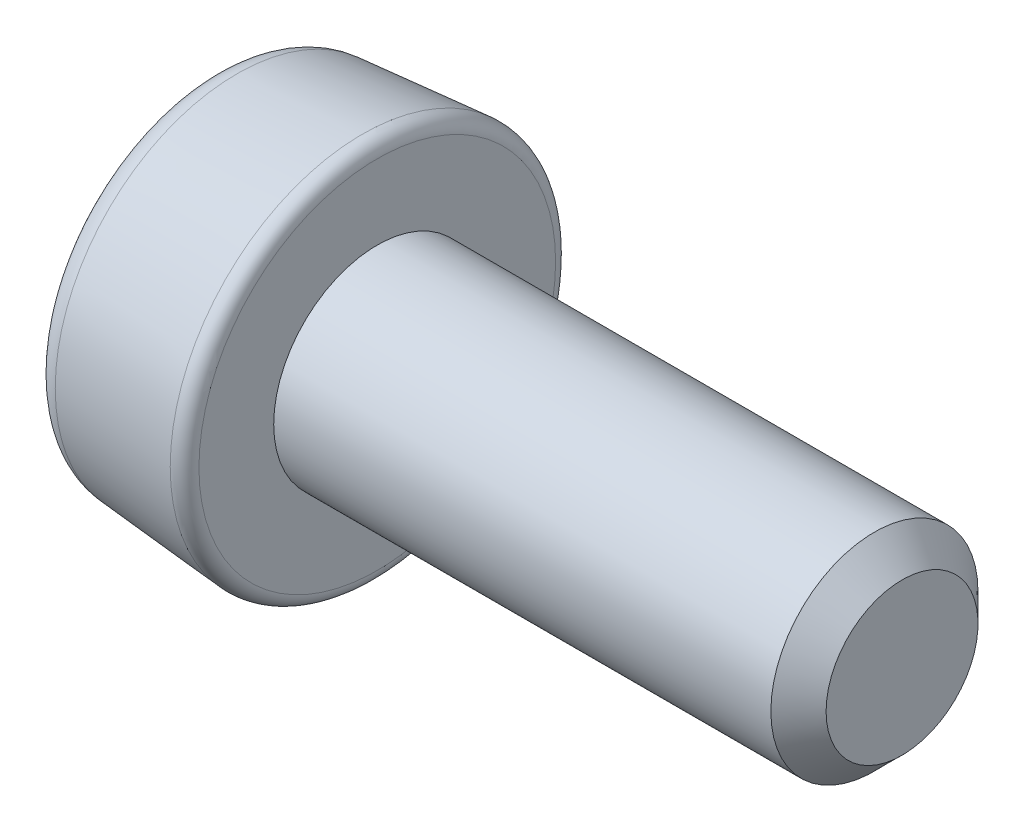
ISO-10303-21;
HEADER;
FILE_DESCRIPTION(('STEP AP214'),'2;1');
FILE_NAME('part.step','',(''),(''),'','','');
FILE_SCHEMA(('AUTOMOTIVE_DESIGN { 1 0 10303 214 1 1 1 1 }'));
ENDSEC;
DATA;
#1=APPLICATION_CONTEXT('core data for automotive mechanical design processes');
#2=APPLICATION_PROTOCOL_DEFINITION('international standard','automotive_design',2000,#1);
#3=PRODUCT_CONTEXT('',#1,'mechanical');
#4=PRODUCT('Part','Part','',(#3));
#5=PRODUCT_RELATED_PRODUCT_CATEGORY('part','',(#4));
#6=PRODUCT_DEFINITION_FORMATION('','',#4);
#7=PRODUCT_DEFINITION_CONTEXT('part definition',#1,'design');
#8=PRODUCT_DEFINITION('design','',#6,#7);
#9=PRODUCT_DEFINITION_SHAPE('','',#8);
#10=(LENGTH_UNIT() NAMED_UNIT(*) SI_UNIT(.MILLI.,.METRE.));
#11=(NAMED_UNIT(*) PLANE_ANGLE_UNIT() SI_UNIT($,.RADIAN.));
#12=(NAMED_UNIT(*) SI_UNIT($,.STERADIAN.) SOLID_ANGLE_UNIT());
#13=UNCERTAINTY_MEASURE_WITH_UNIT(LENGTH_MEASURE(1.E-05),#10,'distance_accuracy_value','');
#14=(GEOMETRIC_REPRESENTATION_CONTEXT(3) GLOBAL_UNCERTAINTY_ASSIGNED_CONTEXT((#13)) GLOBAL_UNIT_ASSIGNED_CONTEXT((#10,
#11,#12)) REPRESENTATION_CONTEXT('',''));
#15=CARTESIAN_POINT('',(0.,0.,0.));
#16=DIRECTION('',(0.,0.,1.));
#17=DIRECTION('',(1.,0.,0.));
#18=AXIS2_PLACEMENT_3D('',#15,#16,#17);
#19=CARTESIAN_POINT('',(-1.2,1.1159734236868,0.));
#20=DIRECTION('',(1.,0.,0.));
#21=DIRECTION('',(0.,0.,-1.));
#22=AXIS2_PLACEMENT_3D('',#19,#20,#21);
#23=PLANE('',#22);
#24=DIRECTION('',(0.,1.,0.));
#25=VECTOR('',#24,1.);
#26=CARTESIAN_POINT('',(-1.2,0.,0.15));
#27=LINE('',#26,#25);
#28=CARTESIAN_POINT('',(-1.2,0.349999999999998,0.15));
#29=VERTEX_POINT('',#28);
#30=CARTESIAN_POINT('',(-1.2,0.7,0.15));
#31=VERTEX_POINT('',#30);
#32=EDGE_CURVE('E229',#29,#31,#27,.T.);
#33=ORIENTED_EDGE('',*,*,#32,.F.);
#34=DIRECTION('',(0.,0.707106781186543,-0.707106781186552));
#35=VECTOR('',#34,1.);
#36=CARTESIAN_POINT('',(-1.2,0.349999999999998,0.15));
#37=LINE('',#36,#35);
#38=CARTESIAN_POINT('',(-1.2,0.150000000000001,0.35));
#39=VERTEX_POINT('',#38);
#40=EDGE_CURVE('E267',#29,#39,#37,.F.);
#41=ORIENTED_EDGE('',*,*,#40,.T.);
#42=DIRECTION('',(0.,0.,-1.));
#43=VECTOR('',#42,1.);
#44=CARTESIAN_POINT('',(-1.2,0.15,0.));
#45=LINE('',#44,#43);
#46=CARTESIAN_POINT('',(-1.2,0.150000000000007,0.699999999999999));
#47=VERTEX_POINT('',#46);
#48=EDGE_CURVE('E208',#47,#39,#45,.T.);
#49=ORIENTED_EDGE('',*,*,#48,.F.);
#50=DIRECTION('',(0.,1.,0.));
#51=VECTOR('',#50,1.);
#52=CARTESIAN_POINT('',(-1.2,0.150000000000007,0.699999999999999));
#53=LINE('',#52,#51);
#54=CARTESIAN_POINT('',(-1.2,-0.149999999999993,0.700000000000002));
#55=VERTEX_POINT('',#54);
#56=EDGE_CURVE('E154',#55,#47,#53,.T.);
#57=ORIENTED_EDGE('',*,*,#56,.F.);
#58=DIRECTION('',(0.,0.,1.));
#59=VECTOR('',#58,1.);
#60=CARTESIAN_POINT('',(-1.2,-0.15,0.));
#61=LINE('',#60,#59);
#62=CARTESIAN_POINT('',(-1.2,-0.149999999999996,0.350000000000003));
#63=VERTEX_POINT('',#62);
#64=EDGE_CURVE('E160',#63,#55,#61,.T.);
#65=ORIENTED_EDGE('',*,*,#64,.F.);
#66=DIRECTION('',(0.,0.707106781186554,0.707106781186541));
#67=VECTOR('',#66,1.);
#68=CARTESIAN_POINT('',(-1.2,-0.35,0.150000000000002));
#69=LINE('',#68,#67);
#70=CARTESIAN_POINT('',(-1.2,-0.35,0.150000000000002));
#71=VERTEX_POINT('',#70);
#72=EDGE_CURVE('E265',#63,#71,#69,.F.);
#73=ORIENTED_EDGE('',*,*,#72,.T.);
#74=DIRECTION('',(0.,1.,0.));
#75=VECTOR('',#74,1.);
#76=CARTESIAN_POINT('',(-1.2,0.,0.15));
#77=LINE('',#76,#75);
#78=CARTESIAN_POINT('',(-1.2,-0.699999999999999,0.150000000000005));
#79=VERTEX_POINT('',#78);
#80=EDGE_CURVE('E172',#79,#71,#77,.T.);
#81=ORIENTED_EDGE('',*,*,#80,.F.);
#82=DIRECTION('',(0.,0.,1.));
#83=VECTOR('',#82,1.);
#84=CARTESIAN_POINT('',(-1.2,-0.699999999999999,0.150000000000005));
#85=LINE('',#84,#83);
#86=CARTESIAN_POINT('',(-1.2,-0.700000000000001,-0.149999999999995));
#87=VERTEX_POINT('',#86);
#88=EDGE_CURVE('E177',#87,#79,#85,.T.);
#89=ORIENTED_EDGE('',*,*,#88,.F.);
#90=DIRECTION('',(0.,-1.,0.));
#91=VECTOR('',#90,1.);
#92=CARTESIAN_POINT('',(-1.2,0.,-0.15));
#93=LINE('',#92,#91);
#94=CARTESIAN_POINT('',(-1.2,-0.350000000000003,-0.149999999999998));
#95=VERTEX_POINT('',#94);
#96=EDGE_CURVE('E185',#95,#87,#93,.T.);
#97=ORIENTED_EDGE('',*,*,#96,.F.);
#98=DIRECTION('',(0.,-0.707106781186544,0.707106781186551));
#99=VECTOR('',#98,1.);
#100=CARTESIAN_POINT('',(-1.2,-0.150000000000001,-0.350000000000001));
#101=LINE('',#100,#99);
#102=CARTESIAN_POINT('',(-1.2,-0.150000000000001,-0.350000000000001));
#103=VERTEX_POINT('',#102);
#104=EDGE_CURVE('E263',#95,#103,#101,.F.);
#105=ORIENTED_EDGE('',*,*,#104,.T.);
#106=DIRECTION('',(0.,0.,1.));
#107=VECTOR('',#106,1.);
#108=CARTESIAN_POINT('',(-1.2,-0.15,0.));
#109=LINE('',#108,#107);
#110=CARTESIAN_POINT('',(-1.2,-0.150000000000002,-0.699999999999999));
#111=VERTEX_POINT('',#110);
#112=EDGE_CURVE('E191',#111,#103,#109,.T.);
#113=ORIENTED_EDGE('',*,*,#112,.F.);
#114=DIRECTION('',(0.,-1.,0.));
#115=VECTOR('',#114,1.);
#116=CARTESIAN_POINT('',(-1.2,-0.150000000000002,-0.699999999999999));
#117=LINE('',#116,#115);
#118=CARTESIAN_POINT('',(-1.2,0.149999999999998,-0.700000000000001));
#119=VERTEX_POINT('',#118);
#120=EDGE_CURVE('E198',#119,#111,#117,.T.);
#121=ORIENTED_EDGE('',*,*,#120,.F.);
#122=CARTESIAN_POINT('',(-1.2,0.149999999999999,-0.35));
#123=VERTEX_POINT('',#122);
#124=EDGE_CURVE('E207',#123,#119,#45,.T.);
#125=ORIENTED_EDGE('',*,*,#124,.F.);
#126=DIRECTION('',(0.,-0.707106781186549,-0.707106781186546));
#127=VECTOR('',#126,1.);
#128=CARTESIAN_POINT('',(-1.2,0.35,-0.15));
#129=LINE('',#128,#127);
#130=CARTESIAN_POINT('',(-1.2,0.35,-0.15));
#131=VERTEX_POINT('',#130);
#132=EDGE_CURVE('E261',#123,#131,#129,.F.);
#133=ORIENTED_EDGE('',*,*,#132,.T.);
#134=DIRECTION('',(0.,-1.,0.));
#135=VECTOR('',#134,1.);
#136=CARTESIAN_POINT('',(-1.2,0.,-0.15));
#137=LINE('',#136,#135);
#138=CARTESIAN_POINT('',(-1.2,0.7,-0.15));
#139=VERTEX_POINT('',#138);
#140=EDGE_CURVE('E215',#139,#131,#137,.T.);
#141=ORIENTED_EDGE('',*,*,#140,.F.);
#142=DIRECTION('',(0.,0.,-1.));
#143=VECTOR('',#142,1.);
#144=CARTESIAN_POINT('',(-1.2,0.7,-0.15));
#145=LINE('',#144,#143);
#146=EDGE_CURVE('E221',#31,#139,#145,.T.);
#147=ORIENTED_EDGE('',*,*,#146,.F.);
#148=EDGE_LOOP('',(#33,#41,#49,#57,#65,#73,#81,#89,#97,#105,#113,#121,#125,#133,#141,#147));
#149=FACE_BOUND('',#148,.T.);
#150=CARTESIAN_POINT('',(-1.2,0.,0.));
#151=DIRECTION('',(-1.,0.,0.));
#152=DIRECTION('',(0.,0.,1.));
#153=AXIS2_PLACEMENT_3D('',#150,#151,#152);
#154=CIRCLE('',#153,1.1159734236868);
#155=CARTESIAN_POINT('',(-1.2,0.,1.1159734236868));
#156=VERTEX_POINT('',#155);
#157=EDGE_CURVE('E255',#156,#156,#154,.T.);
#158=ORIENTED_EDGE('',*,*,#157,.T.);
#159=EDGE_LOOP('',(#158));
#160=FACE_BOUND('',#159,.T.);
#161=ADVANCED_FACE('F34',(#149,#160),#23,.F.);
#162=CARTESIAN_POINT('',(-1.,0.,0.));
#163=DIRECTION('',(-1.,0.,0.));
#164=DIRECTION('',(0.,0.,1.));
#165=AXIS2_PLACEMENT_3D('',#162,#163,#164);
#166=TOROIDAL_SURFACE('',#165,1.1159734236868,0.2);
#167=ORIENTED_EDGE('',*,*,#157,.F.);
#168=EDGE_LOOP('',(#167));
#169=FACE_BOUND('',#168,.T.);
#170=CARTESIAN_POINT('',(-1.01660909597075,0.,0.));
#171=DIRECTION('',(-1.,0.,0.));
#172=DIRECTION('',(0.,0.,1.));
#173=AXIS2_PLACEMENT_3D('',#170,#171,#172);
#174=CIRCLE('',#173,1.31528257533577);
#175=CARTESIAN_POINT('',(-1.01660909597075,0.,1.31528257533577));
#176=VERTEX_POINT('',#175);
#177=EDGE_CURVE('E252',#176,#176,#174,.T.);
#178=ORIENTED_EDGE('',*,*,#177,.T.);
#179=EDGE_LOOP('',(#178));
#180=FACE_BOUND('',#179,.T.);
#181=ADVANCED_FACE('F354',(#169,#180),#166,.T.);
#182=CARTESIAN_POINT('',(-0.108304547985375,0.,0.));
#183=DIRECTION('',(1.,0.,0.));
#184=DIRECTION('',(0.,0.,-1.));
#185=AXIS2_PLACEMENT_3D('',#182,#183,#184);
#186=CONICAL_SURFACE('',#185,1.39097462100122,0.083141231888441);
#187=ORIENTED_EDGE('',*,*,#177,.F.);
#188=EDGE_LOOP('',(#187));
#189=FACE_BOUND('',#188,.T.);
#190=CARTESIAN_POINT('',(-0.108304547985375,0.,0.));
#191=DIRECTION('',(-1.,0.,0.));
#192=DIRECTION('',(0.,0.,1.));
#193=AXIS2_PLACEMENT_3D('',#190,#191,#192);
#194=CIRCLE('',#193,1.39097462100122);
#195=CARTESIAN_POINT('',(-0.108304547985375,0.,1.39097462100122));
#196=VERTEX_POINT('',#195);
#197=EDGE_CURVE('E249',#196,#196,#194,.T.);
#198=ORIENTED_EDGE('',*,*,#197,.T.);
#199=EDGE_LOOP('',(#198));
#200=FACE_BOUND('',#199,.T.);
#201=ADVANCED_FACE('F359',(#189,#200),#186,.T.);
#202=CARTESIAN_POINT('',(-0.1,0.,0.));
#203=DIRECTION('',(-1.,0.,0.));
#204=DIRECTION('',(0.,0.,1.));
#205=AXIS2_PLACEMENT_3D('',#202,#203,#204);
#206=TOROIDAL_SURFACE('',#205,1.29132004517673,0.0999999999999999);
#207=ORIENTED_EDGE('',*,*,#197,.F.);
#208=EDGE_LOOP('',(#207));
#209=FACE_BOUND('',#208,.T.);
#210=CARTESIAN_POINT('',(0.,0.,0.));
#211=DIRECTION('',(-1.,0.,0.));
#212=DIRECTION('',(0.,0.,1.));
#213=AXIS2_PLACEMENT_3D('',#210,#211,#212);
#214=CIRCLE('',#213,1.29132004517673);
#215=CARTESIAN_POINT('',(0.,0.,1.29132004517673));
#216=VERTEX_POINT('',#215);
#217=EDGE_CURVE('E246',#216,#216,#214,.T.);
#218=ORIENTED_EDGE('',*,*,#217,.T.);
#219=EDGE_LOOP('',(#218));
#220=FACE_BOUND('',#219,.T.);
#221=ADVANCED_FACE('F532',(#209,#220),#206,.T.);
#222=CARTESIAN_POINT('',(0.,0.75,0.));
#223=DIRECTION('',(-1.,0.,0.));
#224=DIRECTION('',(0.,0.,1.));
#225=AXIS2_PLACEMENT_3D('',#222,#223,#224);
#226=PLANE('',#225);
#227=ORIENTED_EDGE('',*,*,#217,.F.);
#228=EDGE_LOOP('',(#227));
#229=FACE_BOUND('',#228,.T.);
#230=CARTESIAN_POINT('',(0.,0.,0.));
#231=DIRECTION('',(-1.,0.,0.));
#232=DIRECTION('',(0.,0.,1.));
#233=AXIS2_PLACEMENT_3D('',#230,#231,#232);
#234=CIRCLE('',#233,0.75);
#235=CARTESIAN_POINT('',(0.,0.,0.75));
#236=VERTEX_POINT('',#235);
#237=EDGE_CURVE('E243',#236,#236,#234,.T.);
#238=ORIENTED_EDGE('',*,*,#237,.T.);
#239=EDGE_LOOP('',(#238));
#240=FACE_BOUND('',#239,.T.);
#241=ADVANCED_FACE('F522',(#229,#240),#226,.F.);
#242=CARTESIAN_POINT('',(-2.78391866276236,0.,0.));
#243=DIRECTION('',(-1.,0.,0.));
#244=DIRECTION('',(0.,0.,1.));
#245=AXIS2_PLACEMENT_3D('',#242,#243,#244);
#246=CYLINDRICAL_SURFACE('',#245,0.75);
#247=ORIENTED_EDGE('',*,*,#237,.F.);
#248=EDGE_LOOP('',(#247));
#249=FACE_BOUND('',#248,.T.);
#250=CARTESIAN_POINT('',(3.6,0.,0.));
#251=DIRECTION('',(-1.,0.,0.));
#252=DIRECTION('',(0.,0.,1.));
#253=AXIS2_PLACEMENT_3D('',#250,#251,#252);
#254=CIRCLE('',#253,0.75);
#255=CARTESIAN_POINT('',(3.6,0.,0.75));
#256=VERTEX_POINT('',#255);
#257=EDGE_CURVE('E240',#256,#256,#254,.T.);
#258=ORIENTED_EDGE('',*,*,#257,.T.);
#259=EDGE_LOOP('',(#258));
#260=FACE_BOUND('',#259,.T.);
#261=ADVANCED_FACE('F512',(#249,#260),#246,.T.);
#262=CARTESIAN_POINT('',(3.8,0.,0.));
#263=DIRECTION('',(-1.,0.,0.));
#264=DIRECTION('',(0.,0.,1.));
#265=AXIS2_PLACEMENT_3D('',#262,#263,#264);
#266=CONICAL_SURFACE('',#265,0.549999999999999,0.78539816339745);
#267=ORIENTED_EDGE('',*,*,#257,.F.);
#268=EDGE_LOOP('',(#267));
#269=FACE_BOUND('',#268,.T.);
#270=CARTESIAN_POINT('',(3.8,0.,0.));
#271=DIRECTION('',(-1.,0.,0.));
#272=DIRECTION('',(0.,0.,1.));
#273=AXIS2_PLACEMENT_3D('',#270,#271,#272);
#274=CIRCLE('',#273,0.549999999999999);
#275=CARTESIAN_POINT('',(3.8,0.,0.549999999999999));
#276=VERTEX_POINT('',#275);
#277=EDGE_CURVE('E235',#276,#276,#274,.T.);
#278=ORIENTED_EDGE('',*,*,#277,.T.);
#279=EDGE_LOOP('',(#278));
#280=FACE_BOUND('',#279,.T.);
#281=ADVANCED_FACE('F502',(#269,#280),#266,.T.);
#282=CARTESIAN_POINT('',(3.8,0.,0.));
#283=DIRECTION('',(-1.,0.,0.));
#284=DIRECTION('',(0.,0.,1.));
#285=AXIS2_PLACEMENT_3D('',#282,#283,#284);
#286=PLANE('',#285);
#287=ORIENTED_EDGE('',*,*,#277,.F.);
#288=EDGE_LOOP('',(#287));
#289=FACE_BOUND('',#288,.T.);
#290=ADVANCED_FACE('F466',(#289),#286,.F.);
#291=CARTESIAN_POINT('',(-0.4,0.,-0.15));
#292=DIRECTION('',(0.,0.,-1.));
#293=DIRECTION('',(-1.,0.,0.));
#294=AXIS2_PLACEMENT_3D('',#291,#292,#293);
#295=PLANE('',#294);
#296=ORIENTED_EDGE('',*,*,#140,.T.);
#297=DIRECTION('',(1.,0.,0.));
#298=VECTOR('',#297,1.);
#299=CARTESIAN_POINT('',(-0.4,0.35,-0.15));
#300=LINE('',#299,#298);
#301=CARTESIAN_POINT('',(-0.4,0.35,-0.15));
#302=VERTEX_POINT('',#301);
#303=EDGE_CURVE('E281',#131,#302,#300,.T.);
#304=ORIENTED_EDGE('',*,*,#303,.T.);
#305=DIRECTION('',(0.,-1.,0.));
#306=VECTOR('',#305,1.);
#307=CARTESIAN_POINT('',(-0.4,0.,-0.15));
#308=LINE('',#307,#306);
#309=CARTESIAN_POINT('',(-0.4,0.7,-0.15));
#310=VERTEX_POINT('',#309);
#311=EDGE_CURVE('E218',#310,#302,#308,.T.);
#312=ORIENTED_EDGE('',*,*,#311,.F.);
#313=DIRECTION('',(-1.,0.,0.));
#314=VECTOR('',#313,1.);
#315=CARTESIAN_POINT('',(-0.4,0.7,-0.15));
#316=LINE('',#315,#314);
#317=EDGE_CURVE('E233',#310,#139,#316,.T.);
#318=ORIENTED_EDGE('',*,*,#317,.T.);
#319=EDGE_LOOP('',(#296,#304,#312,#318));
#320=FACE_BOUND('',#319,.T.);
#321=ADVANCED_FACE('F317',(#320),#295,.F.);
#322=CARTESIAN_POINT('',(-0.4,0.7,-0.15));
#323=DIRECTION('',(0.,1.,0.));
#324=DIRECTION('',(0.,0.,1.));
#325=AXIS2_PLACEMENT_3D('',#322,#323,#324);
#326=PLANE('',#325);
#327=ORIENTED_EDGE('',*,*,#146,.T.);
#328=ORIENTED_EDGE('',*,*,#317,.F.);
#329=DIRECTION('',(0.,0.,-1.));
#330=VECTOR('',#329,1.);
#331=CARTESIAN_POINT('',(-0.4,0.7,-0.15));
#332=LINE('',#331,#330);
#333=CARTESIAN_POINT('',(-0.4,0.7,0.15));
#334=VERTEX_POINT('',#333);
#335=EDGE_CURVE('E223',#334,#310,#332,.T.);
#336=ORIENTED_EDGE('',*,*,#335,.F.);
#337=DIRECTION('',(-1.,0.,0.));
#338=VECTOR('',#337,1.);
#339=CARTESIAN_POINT('',(-0.4,0.7,0.15));
#340=LINE('',#339,#338);
#341=EDGE_CURVE('E226',#334,#31,#340,.T.);
#342=ORIENTED_EDGE('',*,*,#341,.T.);
#343=EDGE_LOOP('',(#327,#328,#336,#342));
#344=FACE_BOUND('',#343,.T.);
#345=ADVANCED_FACE('F322',(#344),#326,.F.);
#346=CARTESIAN_POINT('',(-0.4,0.,0.15));
#347=DIRECTION('',(0.,0.,1.));
#348=DIRECTION('',(1.,0.,0.));
#349=AXIS2_PLACEMENT_3D('',#346,#347,#348);
#350=PLANE('',#349);
#351=DIRECTION('',(0.,1.,0.));
#352=VECTOR('',#351,1.);
#353=CARTESIAN_POINT('',(-0.4,0.,0.15));
#354=LINE('',#353,#352);
#355=CARTESIAN_POINT('',(-0.4,0.349999999999998,0.15));
#356=VERTEX_POINT('',#355);
#357=EDGE_CURVE('E220',#356,#334,#354,.T.);
#358=ORIENTED_EDGE('',*,*,#357,.F.);
#359=DIRECTION('',(-1.,0.,0.));
#360=VECTOR('',#359,1.);
#361=CARTESIAN_POINT('',(-0.4,0.349999999999998,0.15));
#362=LINE('',#361,#360);
#363=EDGE_CURVE('E258',#356,#29,#362,.T.);
#364=ORIENTED_EDGE('',*,*,#363,.T.);
#365=ORIENTED_EDGE('',*,*,#32,.T.);
#366=ORIENTED_EDGE('',*,*,#341,.F.);
#367=EDGE_LOOP('',(#358,#364,#365,#366));
#368=FACE_BOUND('',#367,.T.);
#369=ADVANCED_FACE('F326',(#368),#350,.F.);
#370=CARTESIAN_POINT('',(-0.4,0.7,-0.15));
#371=DIRECTION('',(1.,0.,0.));
#372=DIRECTION('',(0.,0.,-1.));
#373=AXIS2_PLACEMENT_3D('',#370,#371,#372);
#374=PLANE('',#373);
#375=DIRECTION('',(0.,0.,-1.));
#376=VECTOR('',#375,1.);
#377=CARTESIAN_POINT('',(-0.4,0.15,0.));
#378=LINE('',#377,#376);
#379=CARTESIAN_POINT('',(-0.4,0.150000000000007,0.699999999999999));
#380=VERTEX_POINT('',#379);
#381=CARTESIAN_POINT('',(-0.4,0.150000000000001,0.35));
#382=VERTEX_POINT('',#381);
#383=EDGE_CURVE('E199',#380,#382,#378,.T.);
#384=ORIENTED_EDGE('',*,*,#383,.T.);
#385=DIRECTION('',(0.,-0.707106781186543,0.707106781186552));
#386=VECTOR('',#385,1.);
#387=CARTESIAN_POINT('',(-0.4,0.674999999999997,-0.175000000000003));
#388=LINE('',#387,#386);
#389=EDGE_CURVE('E285',#382,#356,#388,.F.);
#390=ORIENTED_EDGE('',*,*,#389,.T.);
#391=ORIENTED_EDGE('',*,*,#357,.T.);
#392=ORIENTED_EDGE('',*,*,#335,.T.);
#393=ORIENTED_EDGE('',*,*,#311,.T.);
#394=DIRECTION('',(0.,0.707106781186549,0.707106781186546));
#395=VECTOR('',#394,1.);
#396=CARTESIAN_POINT('',(-0.4,0.525000000000001,0.025));
#397=LINE('',#396,#395);
#398=CARTESIAN_POINT('',(-0.4,0.149999999999999,-0.350000000000001));
#399=VERTEX_POINT('',#398);
#400=EDGE_CURVE('E11',#302,#399,#397,.F.);
#401=ORIENTED_EDGE('',*,*,#400,.T.);
#402=CARTESIAN_POINT('',(-0.4,0.149999999999998,-0.700000000000001));
#403=VERTEX_POINT('',#402);
#404=EDGE_CURVE('E197',#399,#403,#378,.T.);
#405=ORIENTED_EDGE('',*,*,#404,.T.);
#406=DIRECTION('',(0.,-1.,0.));
#407=VECTOR('',#406,1.);
#408=CARTESIAN_POINT('',(-0.4,-0.150000000000002,-0.699999999999999));
#409=LINE('',#408,#407);
#410=CARTESIAN_POINT('',(-0.4,-0.150000000000002,-0.699999999999999));
#411=VERTEX_POINT('',#410);
#412=EDGE_CURVE('E201',#403,#411,#409,.T.);
#413=ORIENTED_EDGE('',*,*,#412,.T.);
#414=DIRECTION('',(0.,0.,1.));
#415=VECTOR('',#414,1.);
#416=CARTESIAN_POINT('',(-0.4,-0.15,0.));
#417=LINE('',#416,#415);
#418=CARTESIAN_POINT('',(-0.4,-0.150000000000001,-0.350000000000001));
#419=VERTEX_POINT('',#418);
#420=EDGE_CURVE('E194',#411,#419,#417,.T.);
#421=ORIENTED_EDGE('',*,*,#420,.T.);
#422=DIRECTION('',(0.,0.707106781186544,-0.707106781186551));
#423=VECTOR('',#422,1.);
#424=CARTESIAN_POINT('',(-0.4,0.174999999999995,-0.675));
#425=LINE('',#424,#423);
#426=CARTESIAN_POINT('',(-0.4,-0.350000000000003,-0.149999999999998));
#427=VERTEX_POINT('',#426);
#428=EDGE_CURVE('E42',#419,#427,#425,.F.);
#429=ORIENTED_EDGE('',*,*,#428,.T.);
#430=DIRECTION('',(0.,-1.,0.));
#431=VECTOR('',#430,1.);
#432=CARTESIAN_POINT('',(-0.4,0.,-0.15));
#433=LINE('',#432,#431);
#434=CARTESIAN_POINT('',(-0.4,-0.700000000000001,-0.149999999999995));
#435=VERTEX_POINT('',#434);
#436=EDGE_CURVE('E176',#427,#435,#433,.T.);
#437=ORIENTED_EDGE('',*,*,#436,.T.);
#438=DIRECTION('',(0.,0.,1.));
#439=VECTOR('',#438,1.);
#440=CARTESIAN_POINT('',(-0.4,-0.699999999999999,0.150000000000005));
#441=LINE('',#440,#439);
#442=CARTESIAN_POINT('',(-0.4,-0.699999999999999,0.150000000000005));
#443=VERTEX_POINT('',#442);
#444=EDGE_CURVE('E179',#435,#443,#441,.T.);
#445=ORIENTED_EDGE('',*,*,#444,.T.);
#446=DIRECTION('',(0.,1.,0.));
#447=VECTOR('',#446,1.);
#448=CARTESIAN_POINT('',(-0.4,0.,0.15));
#449=LINE('',#448,#447);
#450=CARTESIAN_POINT('',(-0.4,-0.35,0.150000000000002));
#451=VERTEX_POINT('',#450);
#452=EDGE_CURVE('E174',#443,#451,#449,.T.);
#453=ORIENTED_EDGE('',*,*,#452,.T.);
#454=DIRECTION('',(0.,-0.707106781186554,-0.707106781186541));
#455=VECTOR('',#454,1.);
#456=CARTESIAN_POINT('',(-0.4,0.0250000000000077,0.525000000000004));
#457=LINE('',#456,#455);
#458=CARTESIAN_POINT('',(-0.4,-0.149999999999996,0.350000000000003));
#459=VERTEX_POINT('',#458);
#460=EDGE_CURVE('E151',#451,#459,#457,.F.);
#461=ORIENTED_EDGE('',*,*,#460,.T.);
#462=DIRECTION('',(0.,0.,1.));
#463=VECTOR('',#462,1.);
#464=CARTESIAN_POINT('',(-0.4,-0.15,0.));
#465=LINE('',#464,#463);
#466=CARTESIAN_POINT('',(-0.4,-0.149999999999993,0.700000000000002));
#467=VERTEX_POINT('',#466);
#468=EDGE_CURVE('E144',#459,#467,#465,.T.);
#469=ORIENTED_EDGE('',*,*,#468,.T.);
#470=DIRECTION('',(0.,1.,0.));
#471=VECTOR('',#470,1.);
#472=CARTESIAN_POINT('',(-0.4,0.150000000000007,0.699999999999999));
#473=LINE('',#472,#471);
#474=EDGE_CURVE('E149',#467,#380,#473,.T.);
#475=ORIENTED_EDGE('',*,*,#474,.T.);
#476=EDGE_LOOP('',(#384,#390,#391,#392,#393,#401,#405,#413,#421,#429,#437,#445,#453,#461,#469,#475));
#477=FACE_BOUND('',#476,.T.);
#478=ADVANCED_FACE('F147',(#477),#374,.F.);
#479=CARTESIAN_POINT('',(-0.4,0.15,0.));
#480=DIRECTION('',(0.,1.,0.));
#481=DIRECTION('',(0.,0.,1.));
#482=AXIS2_PLACEMENT_3D('',#479,#480,#481);
#483=PLANE('',#482);
#484=ORIENTED_EDGE('',*,*,#404,.F.);
#485=DIRECTION('',(-1.,0.,0.));
#486=VECTOR('',#485,1.);
#487=CARTESIAN_POINT('',(-0.4,0.149999999999999,-0.350000000000001));
#488=LINE('',#487,#486);
#489=EDGE_CURVE('E283',#399,#123,#488,.T.);
#490=ORIENTED_EDGE('',*,*,#489,.T.);
#491=ORIENTED_EDGE('',*,*,#124,.T.);
#492=DIRECTION('',(-1.,0.,0.));
#493=VECTOR('',#492,1.);
#494=CARTESIAN_POINT('',(-0.4,0.149999999999998,-0.700000000000001));
#495=LINE('',#494,#493);
#496=EDGE_CURVE('E204',#403,#119,#495,.T.);
#497=ORIENTED_EDGE('',*,*,#496,.F.);
#498=EDGE_LOOP('',(#484,#490,#491,#497));
#499=FACE_BOUND('',#498,.T.);
#500=ADVANCED_FACE('F430',(#499),#483,.F.);
#501=ORIENTED_EDGE('',*,*,#48,.T.);
#502=DIRECTION('',(1.,0.,0.));
#503=VECTOR('',#502,1.);
#504=CARTESIAN_POINT('',(-0.4,0.150000000000001,0.35));
#505=LINE('',#504,#503);
#506=EDGE_CURVE('E269',#39,#382,#505,.T.);
#507=ORIENTED_EDGE('',*,*,#506,.T.);
#508=ORIENTED_EDGE('',*,*,#383,.F.);
#509=DIRECTION('',(-1.,0.,0.));
#510=VECTOR('',#509,1.);
#511=CARTESIAN_POINT('',(-0.4,0.150000000000007,0.699999999999999));
#512=LINE('',#511,#510);
#513=EDGE_CURVE('E164',#380,#47,#512,.T.);
#514=ORIENTED_EDGE('',*,*,#513,.T.);
#515=EDGE_LOOP('',(#501,#507,#508,#514));
#516=FACE_BOUND('',#515,.T.);
#517=ADVANCED_FACE('F333',(#516),#483,.F.);
#518=CARTESIAN_POINT('',(-0.4,-0.15,0.));
#519=DIRECTION('',(0.,-1.,0.));
#520=DIRECTION('',(0.,0.,-1.));
#521=AXIS2_PLACEMENT_3D('',#518,#519,#520);
#522=PLANE('',#521);
#523=ORIENTED_EDGE('',*,*,#112,.T.);
#524=DIRECTION('',(1.,0.,0.));
#525=VECTOR('',#524,1.);
#526=CARTESIAN_POINT('',(-0.4,-0.150000000000001,-0.350000000000001));
#527=LINE('',#526,#525);
#528=EDGE_CURVE('E276',#103,#419,#527,.T.);
#529=ORIENTED_EDGE('',*,*,#528,.T.);
#530=ORIENTED_EDGE('',*,*,#420,.F.);
#531=DIRECTION('',(-1.,0.,0.));
#532=VECTOR('',#531,1.);
#533=CARTESIAN_POINT('',(-0.4,-0.150000000000002,-0.699999999999999));
#534=LINE('',#533,#532);
#535=EDGE_CURVE('E213',#411,#111,#534,.T.);
#536=ORIENTED_EDGE('',*,*,#535,.T.);
#537=EDGE_LOOP('',(#523,#529,#530,#536));
#538=FACE_BOUND('',#537,.T.);
#539=ADVANCED_FACE('F306',(#538),#522,.F.);
#540=CARTESIAN_POINT('',(-0.4,-0.150000000000002,-0.699999999999999));
#541=DIRECTION('',(0.,0.,-1.));
#542=DIRECTION('',(0.,1.,0.));
#543=AXIS2_PLACEMENT_3D('',#540,#541,#542);
#544=PLANE('',#543);
#545=ORIENTED_EDGE('',*,*,#120,.T.);
#546=ORIENTED_EDGE('',*,*,#535,.F.);
#547=ORIENTED_EDGE('',*,*,#412,.F.);
#548=ORIENTED_EDGE('',*,*,#496,.T.);
#549=EDGE_LOOP('',(#545,#546,#547,#548));
#550=FACE_BOUND('',#549,.T.);
#551=ADVANCED_FACE('F309',(#550),#544,.F.);
#552=CARTESIAN_POINT('',(-0.4,0.,0.15));
#553=DIRECTION('',(0.,0.,1.));
#554=DIRECTION('',(0.,-1.,0.));
#555=AXIS2_PLACEMENT_3D('',#552,#553,#554);
#556=PLANE('',#555);
#557=ORIENTED_EDGE('',*,*,#80,.T.);
#558=DIRECTION('',(1.,0.,0.));
#559=VECTOR('',#558,1.);
#560=CARTESIAN_POINT('',(-0.4,-0.35,0.150000000000002));
#561=LINE('',#560,#559);
#562=EDGE_CURVE('E271',#71,#451,#561,.T.);
#563=ORIENTED_EDGE('',*,*,#562,.T.);
#564=ORIENTED_EDGE('',*,*,#452,.F.);
#565=DIRECTION('',(-1.,0.,0.));
#566=VECTOR('',#565,1.);
#567=CARTESIAN_POINT('',(-0.4,-0.699999999999999,0.150000000000005));
#568=LINE('',#567,#566);
#569=EDGE_CURVE('E189',#443,#79,#568,.T.);
#570=ORIENTED_EDGE('',*,*,#569,.T.);
#571=EDGE_LOOP('',(#557,#563,#564,#570));
#572=FACE_BOUND('',#571,.T.);
#573=ADVANCED_FACE('F341',(#572),#556,.F.);
#574=CARTESIAN_POINT('',(-0.4,-0.699999999999999,0.150000000000005));
#575=DIRECTION('',(0.,-1.,0.));
#576=DIRECTION('',(0.,0.,-1.));
#577=AXIS2_PLACEMENT_3D('',#574,#575,#576);
#578=PLANE('',#577);
#579=ORIENTED_EDGE('',*,*,#88,.T.);
#580=ORIENTED_EDGE('',*,*,#569,.F.);
#581=ORIENTED_EDGE('',*,*,#444,.F.);
#582=DIRECTION('',(-1.,0.,0.));
#583=VECTOR('',#582,1.);
#584=CARTESIAN_POINT('',(-0.4,-0.700000000000001,-0.149999999999995));
#585=LINE('',#584,#583);
#586=EDGE_CURVE('E182',#435,#87,#585,.T.);
#587=ORIENTED_EDGE('',*,*,#586,.T.);
#588=EDGE_LOOP('',(#579,#580,#581,#587));
#589=FACE_BOUND('',#588,.T.);
#590=ADVANCED_FACE('F343',(#589),#578,.F.);
#591=CARTESIAN_POINT('',(-0.4,0.,-0.15));
#592=DIRECTION('',(0.,0.,-1.));
#593=DIRECTION('',(0.,1.,0.));
#594=AXIS2_PLACEMENT_3D('',#591,#592,#593);
#595=PLANE('',#594);
#596=ORIENTED_EDGE('',*,*,#436,.F.);
#597=DIRECTION('',(-1.,0.,0.));
#598=VECTOR('',#597,1.);
#599=CARTESIAN_POINT('',(-0.4,-0.350000000000003,-0.149999999999998));
#600=LINE('',#599,#598);
#601=EDGE_CURVE('E279',#427,#95,#600,.T.);
#602=ORIENTED_EDGE('',*,*,#601,.T.);
#603=ORIENTED_EDGE('',*,*,#96,.T.);
#604=ORIENTED_EDGE('',*,*,#586,.F.);
#605=EDGE_LOOP('',(#596,#602,#603,#604));
#606=FACE_BOUND('',#605,.T.);
#607=ADVANCED_FACE('F294',(#606),#595,.F.);
#608=CARTESIAN_POINT('',(-0.4,0.150000000000007,0.699999999999999));
#609=DIRECTION('',(0.,0.,1.));
#610=DIRECTION('',(0.,-1.,0.));
#611=AXIS2_PLACEMENT_3D('',#608,#609,#610);
#612=PLANE('',#611);
#613=ORIENTED_EDGE('',*,*,#56,.T.);
#614=ORIENTED_EDGE('',*,*,#513,.F.);
#615=ORIENTED_EDGE('',*,*,#474,.F.);
#616=DIRECTION('',(-1.,0.,0.));
#617=VECTOR('',#616,1.);
#618=CARTESIAN_POINT('',(-0.4,-0.149999999999993,0.700000000000002));
#619=LINE('',#618,#617);
#620=EDGE_CURVE('E157',#467,#55,#619,.T.);
#621=ORIENTED_EDGE('',*,*,#620,.T.);
#622=EDGE_LOOP('',(#613,#614,#615,#621));
#623=FACE_BOUND('',#622,.T.);
#624=ADVANCED_FACE('F167',(#623),#612,.F.);
#625=CARTESIAN_POINT('',(-0.4,-0.15,0.));
#626=DIRECTION('',(0.,-1.,0.));
#627=DIRECTION('',(0.,0.,-1.));
#628=AXIS2_PLACEMENT_3D('',#625,#626,#627);
#629=PLANE('',#628);
#630=ORIENTED_EDGE('',*,*,#468,.F.);
#631=DIRECTION('',(-1.,0.,0.));
#632=VECTOR('',#631,1.);
#633=CARTESIAN_POINT('',(-0.4,-0.149999999999996,0.350000000000003));
#634=LINE('',#633,#632);
#635=EDGE_CURVE('E274',#459,#63,#634,.T.);
#636=ORIENTED_EDGE('',*,*,#635,.T.);
#637=ORIENTED_EDGE('',*,*,#64,.T.);
#638=ORIENTED_EDGE('',*,*,#620,.F.);
#639=EDGE_LOOP('',(#630,#636,#637,#638));
#640=FACE_BOUND('',#639,.T.);
#641=ADVANCED_FACE('F158',(#640),#629,.F.);
#642=CARTESIAN_POINT('',(-0.4,0.349999999999998,0.15));
#643=DIRECTION('',(0.,0.707106781186552,0.707106781186543));
#644=DIRECTION('',(0.,-0.707106781186543,0.707106781186552));
#645=AXIS2_PLACEMENT_3D('',#642,#643,#644);
#646=PLANE('',#645);
#647=ORIENTED_EDGE('',*,*,#389,.F.);
#648=ORIENTED_EDGE('',*,*,#506,.F.);
#649=ORIENTED_EDGE('',*,*,#40,.F.);
#650=ORIENTED_EDGE('',*,*,#363,.F.);
#651=EDGE_LOOP('',(#647,#648,#649,#650));
#652=FACE_BOUND('',#651,.T.);
#653=ADVANCED_FACE('F330',(#652),#646,.F.);
#654=CARTESIAN_POINT('',(-0.4,-0.35,0.150000000000002));
#655=DIRECTION('',(0.,-0.707106781186541,0.707106781186554));
#656=DIRECTION('',(0.,-0.707106781186554,-0.707106781186541));
#657=AXIS2_PLACEMENT_3D('',#654,#655,#656);
#658=PLANE('',#657);
#659=ORIENTED_EDGE('',*,*,#72,.F.);
#660=ORIENTED_EDGE('',*,*,#635,.F.);
#661=ORIENTED_EDGE('',*,*,#460,.F.);
#662=ORIENTED_EDGE('',*,*,#562,.F.);
#663=EDGE_LOOP('',(#659,#660,#661,#662));
#664=FACE_BOUND('',#663,.T.);
#665=ADVANCED_FACE('F338',(#664),#658,.F.);
#666=CARTESIAN_POINT('',(-0.4,-0.150000000000001,-0.350000000000001));
#667=DIRECTION('',(0.,-0.707106781186551,-0.707106781186545));
#668=DIRECTION('',(0.,0.707106781186544,-0.707106781186551));
#669=AXIS2_PLACEMENT_3D('',#666,#667,#668);
#670=PLANE('',#669);
#671=ORIENTED_EDGE('',*,*,#104,.F.);
#672=ORIENTED_EDGE('',*,*,#601,.F.);
#673=ORIENTED_EDGE('',*,*,#428,.F.);
#674=ORIENTED_EDGE('',*,*,#528,.F.);
#675=EDGE_LOOP('',(#671,#672,#673,#674));
#676=FACE_BOUND('',#675,.T.);
#677=ADVANCED_FACE('F298',(#676),#670,.F.);
#678=CARTESIAN_POINT('',(-0.4,0.35,-0.15));
#679=DIRECTION('',(0.,0.707106781186546,-0.707106781186549));
#680=DIRECTION('',(0.,0.707106781186549,0.707106781186546));
#681=AXIS2_PLACEMENT_3D('',#678,#679,#680);
#682=PLANE('',#681);
#683=ORIENTED_EDGE('',*,*,#132,.F.);
#684=ORIENTED_EDGE('',*,*,#489,.F.);
#685=ORIENTED_EDGE('',*,*,#400,.F.);
#686=ORIENTED_EDGE('',*,*,#303,.F.);
#687=EDGE_LOOP('',(#683,#684,#685,#686));
#688=FACE_BOUND('',#687,.T.);
#689=ADVANCED_FACE('F36',(#688),#682,.F.);
#690=CLOSED_SHELL('',(#161,#181,#201,#221,#241,#261,#281,#290,#321,#345,#369,#478,#500,#517,
#539,#551,#573,#590,#607,#624,#641,#653,#665,#677,#689));
#691=MANIFOLD_SOLID_BREP('B2',#690);
#692=ADVANCED_BREP_SHAPE_REPRESENTATION('',(#18,#691),#14);
#693=SHAPE_DEFINITION_REPRESENTATION(#9,#692);
ENDSEC;
END-ISO-10303-21;
